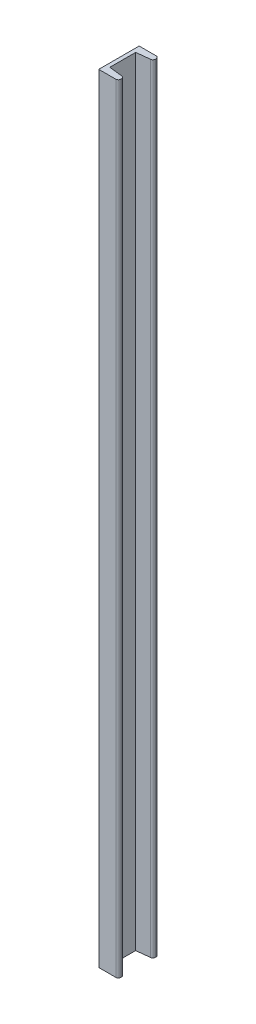
ISO-10303-21;
HEADER;
FILE_DESCRIPTION(('STEP AP214'),'2;1');
FILE_NAME('part.step','',(''),(''),'','','');
FILE_SCHEMA(('AUTOMOTIVE_DESIGN { 1 0 10303 214 1 1 1 1 }'));
ENDSEC;
DATA;
#1=APPLICATION_CONTEXT('core data for automotive mechanical design processes');
#2=APPLICATION_PROTOCOL_DEFINITION('international standard','automotive_design',2000,#1);
#3=PRODUCT_CONTEXT('',#1,'mechanical');
#4=PRODUCT('Part','Part','',(#3));
#5=PRODUCT_RELATED_PRODUCT_CATEGORY('part','',(#4));
#6=PRODUCT_DEFINITION_FORMATION('','',#4);
#7=PRODUCT_DEFINITION_CONTEXT('part definition',#1,'design');
#8=PRODUCT_DEFINITION('design','',#6,#7);
#9=PRODUCT_DEFINITION_SHAPE('','',#8);
#10=(LENGTH_UNIT() NAMED_UNIT(*) SI_UNIT(.MILLI.,.METRE.));
#11=(NAMED_UNIT(*) PLANE_ANGLE_UNIT() SI_UNIT($,.RADIAN.));
#12=(NAMED_UNIT(*) SI_UNIT($,.STERADIAN.) SOLID_ANGLE_UNIT());
#13=UNCERTAINTY_MEASURE_WITH_UNIT(LENGTH_MEASURE(1.E-05),#10,'distance_accuracy_value','');
#14=(GEOMETRIC_REPRESENTATION_CONTEXT(3) GLOBAL_UNCERTAINTY_ASSIGNED_CONTEXT((#13)) GLOBAL_UNIT_ASSIGNED_CONTEXT((#10,
#11,#12)) REPRESENTATION_CONTEXT('',''));
#15=CARTESIAN_POINT('',(0.,0.,0.));
#16=DIRECTION('',(0.,0.,1.));
#17=DIRECTION('',(1.,0.,0.));
#18=AXIS2_PLACEMENT_3D('',#15,#16,#17);
#19=CARTESIAN_POINT('',(0.750000000000001,155.,-6.6));
#20=DIRECTION('',(-1.,0.,0.));
#21=DIRECTION('',(0.,0.,1.));
#22=AXIS2_PLACEMENT_3D('',#19,#20,#21);
#23=PLANE('',#22);
#24=DIRECTION('',(0.,0.,-1.));
#25=VECTOR('',#24,1.);
#26=CARTESIAN_POINT('',(0.750000000000001,0.,-6.6));
#27=LINE('',#26,#25);
#28=CARTESIAN_POINT('',(0.750000000000001,0.,-1.45));
#29=VERTEX_POINT('',#28);
#30=CARTESIAN_POINT('',(0.750000000000001,0.,-6.6));
#31=VERTEX_POINT('',#30);
#32=EDGE_CURVE('E152',#29,#31,#27,.T.);
#33=ORIENTED_EDGE('',*,*,#32,.T.);
#34=DIRECTION('',(0.,-1.,0.));
#35=VECTOR('',#34,1.);
#36=CARTESIAN_POINT('',(0.750000000000001,155.,-6.6));
#37=LINE('',#36,#35);
#38=CARTESIAN_POINT('',(0.750000000000001,155.,-6.6));
#39=VERTEX_POINT('',#38);
#40=EDGE_CURVE('E11',#39,#31,#37,.T.);
#41=ORIENTED_EDGE('',*,*,#40,.F.);
#42=DIRECTION('',(0.,0.,-1.));
#43=VECTOR('',#42,1.);
#44=CARTESIAN_POINT('',(0.750000000000001,155.,-6.6));
#45=LINE('',#44,#43);
#46=CARTESIAN_POINT('',(0.750000000000001,155.,-1.45));
#47=VERTEX_POINT('',#46);
#48=EDGE_CURVE('E174',#47,#39,#45,.T.);
#49=ORIENTED_EDGE('',*,*,#48,.F.);
#50=DIRECTION('',(0.,-1.,0.));
#51=VECTOR('',#50,1.);
#52=CARTESIAN_POINT('',(0.750000000000001,155.,-1.45));
#53=LINE('',#52,#51);
#54=EDGE_CURVE('E148',#47,#29,#53,.T.);
#55=ORIENTED_EDGE('',*,*,#54,.T.);
#56=EDGE_LOOP('',(#33,#41,#49,#55));
#57=FACE_BOUND('',#56,.T.);
#58=ADVANCED_FACE('F32',(#57),#23,.F.);
#59=CARTESIAN_POINT('',(0.750000000000001,155.,-6.6));
#60=DIRECTION('',(-0.110431526074847,0.,-0.993883734673619));
#61=DIRECTION('',(-0.993883734673619,0.,0.110431526074847));
#62=AXIS2_PLACEMENT_3D('',#59,#60,#61);
#63=PLANE('',#62);
#64=DIRECTION('',(0.993883734673619,0.,-0.110431526074847));
#65=VECTOR('',#64,1.);
#66=CARTESIAN_POINT('',(0.750000000000001,0.,-6.6));
#67=LINE('',#66,#65);
#68=CARTESIAN_POINT('',(3.45521576303742,0.,-6.90057952922638));
#69=VERTEX_POINT('',#68);
#70=EDGE_CURVE('E155',#31,#69,#67,.T.);
#71=ORIENTED_EDGE('',*,*,#70,.T.);
#72=DIRECTION('',(0.,-1.,0.));
#73=VECTOR('',#72,1.);
#74=CARTESIAN_POINT('',(3.45521576303742,155.,-6.90057952922638));
#75=LINE('',#74,#73);
#76=CARTESIAN_POINT('',(3.45521576303742,155.,-6.90057952922638));
#77=VERTEX_POINT('',#76);
#78=EDGE_CURVE('E40',#77,#69,#75,.T.);
#79=ORIENTED_EDGE('',*,*,#78,.F.);
#80=DIRECTION('',(0.993883734673619,0.,-0.110431526074847));
#81=VECTOR('',#80,1.);
#82=CARTESIAN_POINT('',(0.750000000000001,155.,-6.6));
#83=LINE('',#82,#81);
#84=EDGE_CURVE('E103',#39,#77,#83,.T.);
#85=ORIENTED_EDGE('',*,*,#84,.F.);
#86=ORIENTED_EDGE('',*,*,#40,.T.);
#87=EDGE_LOOP('',(#71,#79,#85,#86));
#88=FACE_BOUND('',#87,.T.);
#89=ADVANCED_FACE('F252',(#88),#63,.F.);
#90=CARTESIAN_POINT('',(3.4,155.,-7.39752139656319));
#91=DIRECTION('',(0.,-1.,0.));
#92=DIRECTION('',(0.,0.,-1.));
#93=AXIS2_PLACEMENT_3D('',#90,#91,#92);
#94=CYLINDRICAL_SURFACE('',#93,0.5);
#95=CARTESIAN_POINT('',(3.4,0.,-7.39752139656319));
#96=DIRECTION('',(0.,1.,0.));
#97=DIRECTION('',(0.,0.,1.));
#98=AXIS2_PLACEMENT_3D('',#95,#96,#97);
#99=CIRCLE('',#98,0.5);
#100=CARTESIAN_POINT('',(3.9,0.,-7.39752139656319));
#101=VERTEX_POINT('',#100);
#102=EDGE_CURVE('E157',#69,#101,#99,.T.);
#103=ORIENTED_EDGE('',*,*,#102,.T.);
#104=DIRECTION('',(0.,-1.,0.));
#105=VECTOR('',#104,1.);
#106=CARTESIAN_POINT('',(3.9,155.,-7.39752139656319));
#107=LINE('',#106,#105);
#108=CARTESIAN_POINT('',(3.9,155.,-7.39752139656319));
#109=VERTEX_POINT('',#108);
#110=EDGE_CURVE('E193',#109,#101,#107,.T.);
#111=ORIENTED_EDGE('',*,*,#110,.F.);
#112=CARTESIAN_POINT('',(3.4,155.,-7.39752139656319));
#113=DIRECTION('',(0.,1.,0.));
#114=DIRECTION('',(0.,0.,1.));
#115=AXIS2_PLACEMENT_3D('',#112,#113,#114);
#116=CIRCLE('',#115,0.5);
#117=EDGE_CURVE('E201',#77,#109,#116,.T.);
#118=ORIENTED_EDGE('',*,*,#117,.F.);
#119=ORIENTED_EDGE('',*,*,#78,.T.);
#120=EDGE_LOOP('',(#103,#111,#118,#119));
#121=FACE_BOUND('',#120,.T.);
#122=ADVANCED_FACE('F199',(#121),#94,.T.);
#123=CARTESIAN_POINT('',(3.9,155.,-7.39752139656319));
#124=DIRECTION('',(-1.,0.,0.));
#125=DIRECTION('',(0.,0.,1.));
#126=AXIS2_PLACEMENT_3D('',#123,#124,#125);
#127=PLANE('',#126);
#128=DIRECTION('',(0.,0.,-1.));
#129=VECTOR('',#128,1.);
#130=CARTESIAN_POINT('',(3.9,0.,-7.39752139656319));
#131=LINE('',#130,#129);
#132=CARTESIAN_POINT('',(3.9,0.,-7.55));
#133=VERTEX_POINT('',#132);
#134=EDGE_CURVE('E159',#101,#133,#131,.T.);
#135=ORIENTED_EDGE('',*,*,#134,.T.);
#136=DIRECTION('',(0.,-1.,0.));
#137=VECTOR('',#136,1.);
#138=CARTESIAN_POINT('',(3.9,155.,-7.55));
#139=LINE('',#138,#137);
#140=CARTESIAN_POINT('',(3.9,155.,-7.55));
#141=VERTEX_POINT('',#140);
#142=EDGE_CURVE('E190',#141,#133,#139,.T.);
#143=ORIENTED_EDGE('',*,*,#142,.F.);
#144=DIRECTION('',(0.,0.,-1.));
#145=VECTOR('',#144,1.);
#146=CARTESIAN_POINT('',(3.9,155.,-7.39752139656319));
#147=LINE('',#146,#145);
#148=EDGE_CURVE('E219',#109,#141,#147,.T.);
#149=ORIENTED_EDGE('',*,*,#148,.F.);
#150=ORIENTED_EDGE('',*,*,#110,.T.);
#151=EDGE_LOOP('',(#135,#143,#149,#150));
#152=FACE_BOUND('',#151,.T.);
#153=ADVANCED_FACE('F210',(#152),#127,.F.);
#154=CARTESIAN_POINT('',(3.4,155.,-7.55));
#155=DIRECTION('',(0.,-1.,0.));
#156=DIRECTION('',(0.,0.,-1.));
#157=AXIS2_PLACEMENT_3D('',#154,#155,#156);
#158=CYLINDRICAL_SURFACE('',#157,0.5);
#159=CARTESIAN_POINT('',(3.4,0.,-7.55));
#160=DIRECTION('',(0.,1.,0.));
#161=DIRECTION('',(0.,0.,1.));
#162=AXIS2_PLACEMENT_3D('',#159,#160,#161);
#163=CIRCLE('',#162,0.5);
#164=CARTESIAN_POINT('',(3.4,0.,-8.05));
#165=VERTEX_POINT('',#164);
#166=EDGE_CURVE('E161',#133,#165,#163,.T.);
#167=ORIENTED_EDGE('',*,*,#166,.T.);
#168=DIRECTION('',(0.,-1.,0.));
#169=VECTOR('',#168,1.);
#170=CARTESIAN_POINT('',(3.4,155.,-8.05));
#171=LINE('',#170,#169);
#172=CARTESIAN_POINT('',(3.4,155.,-8.05));
#173=VERTEX_POINT('',#172);
#174=EDGE_CURVE('E187',#173,#165,#171,.T.);
#175=ORIENTED_EDGE('',*,*,#174,.F.);
#176=CARTESIAN_POINT('',(3.4,155.,-7.55));
#177=DIRECTION('',(0.,1.,0.));
#178=DIRECTION('',(0.,0.,1.));
#179=AXIS2_PLACEMENT_3D('',#176,#177,#178);
#180=CIRCLE('',#179,0.5);
#181=EDGE_CURVE('E216',#141,#173,#180,.T.);
#182=ORIENTED_EDGE('',*,*,#181,.F.);
#183=ORIENTED_EDGE('',*,*,#142,.T.);
#184=EDGE_LOOP('',(#167,#175,#182,#183));
#185=FACE_BOUND('',#184,.T.);
#186=ADVANCED_FACE('F214',(#185),#158,.T.);
#187=CARTESIAN_POINT('',(3.4,155.,-8.05));
#188=DIRECTION('',(0.,0.,1.));
#189=DIRECTION('',(1.,0.,0.));
#190=AXIS2_PLACEMENT_3D('',#187,#188,#189);
#191=PLANE('',#190);
#192=DIRECTION('',(-1.,0.,0.));
#193=VECTOR('',#192,1.);
#194=CARTESIAN_POINT('',(3.4,0.,-8.05));
#195=LINE('',#194,#193);
#196=CARTESIAN_POINT('',(0.,0.,-8.05));
#197=VERTEX_POINT('',#196);
#198=EDGE_CURVE('E163',#165,#197,#195,.T.);
#199=ORIENTED_EDGE('',*,*,#198,.T.);
#200=DIRECTION('',(0.,-1.,0.));
#201=VECTOR('',#200,1.);
#202=CARTESIAN_POINT('',(0.,155.,-8.05));
#203=LINE('',#202,#201);
#204=CARTESIAN_POINT('',(0.,155.,-8.05));
#205=VERTEX_POINT('',#204);
#206=EDGE_CURVE('E184',#205,#197,#203,.T.);
#207=ORIENTED_EDGE('',*,*,#206,.F.);
#208=DIRECTION('',(-1.,0.,0.));
#209=VECTOR('',#208,1.);
#210=CARTESIAN_POINT('',(3.4,155.,-8.05));
#211=LINE('',#210,#209);
#212=EDGE_CURVE('E218',#173,#205,#211,.T.);
#213=ORIENTED_EDGE('',*,*,#212,.F.);
#214=ORIENTED_EDGE('',*,*,#174,.T.);
#215=EDGE_LOOP('',(#199,#207,#213,#214));
#216=FACE_BOUND('',#215,.T.);
#217=ADVANCED_FACE('F265',(#216),#191,.F.);
#218=CARTESIAN_POINT('',(0.,155.,0.));
#219=DIRECTION('',(1.,0.,0.));
#220=DIRECTION('',(0.,0.,-1.));
#221=AXIS2_PLACEMENT_3D('',#218,#219,#220);
#222=PLANE('',#221);
#223=DIRECTION('',(0.,0.,1.));
#224=VECTOR('',#223,1.);
#225=CARTESIAN_POINT('',(0.,0.,0.));
#226=LINE('',#225,#224);
#227=CARTESIAN_POINT('',(0.,0.,0.));
#228=VERTEX_POINT('',#227);
#229=EDGE_CURVE('E165',#197,#228,#226,.T.);
#230=ORIENTED_EDGE('',*,*,#229,.T.);
#231=DIRECTION('',(0.,-1.,0.));
#232=VECTOR('',#231,1.);
#233=CARTESIAN_POINT('',(0.,155.,0.));
#234=LINE('',#233,#232);
#235=CARTESIAN_POINT('',(0.,155.,0.));
#236=VERTEX_POINT('',#235);
#237=EDGE_CURVE('E181',#236,#228,#234,.T.);
#238=ORIENTED_EDGE('',*,*,#237,.F.);
#239=DIRECTION('',(0.,0.,1.));
#240=VECTOR('',#239,1.);
#241=CARTESIAN_POINT('',(0.,155.,0.));
#242=LINE('',#241,#240);
#243=EDGE_CURVE('E221',#205,#236,#242,.T.);
#244=ORIENTED_EDGE('',*,*,#243,.F.);
#245=ORIENTED_EDGE('',*,*,#206,.T.);
#246=EDGE_LOOP('',(#230,#238,#244,#245));
#247=FACE_BOUND('',#246,.T.);
#248=ADVANCED_FACE('F268',(#247),#222,.F.);
#249=CARTESIAN_POINT('',(3.4,155.,0.));
#250=DIRECTION('',(0.,0.,-1.));
#251=DIRECTION('',(-1.,0.,0.));
#252=AXIS2_PLACEMENT_3D('',#249,#250,#251);
#253=PLANE('',#252);
#254=DIRECTION('',(1.,0.,0.));
#255=VECTOR('',#254,1.);
#256=CARTESIAN_POINT('',(3.4,0.,0.));
#257=LINE('',#256,#255);
#258=CARTESIAN_POINT('',(3.4,0.,0.));
#259=VERTEX_POINT('',#258);
#260=EDGE_CURVE('E167',#228,#259,#257,.T.);
#261=ORIENTED_EDGE('',*,*,#260,.T.);
#262=DIRECTION('',(0.,-1.,0.));
#263=VECTOR('',#262,1.);
#264=CARTESIAN_POINT('',(3.4,155.,0.));
#265=LINE('',#264,#263);
#266=CARTESIAN_POINT('',(3.4,155.,0.));
#267=VERTEX_POINT('',#266);
#268=EDGE_CURVE('E178',#267,#259,#265,.T.);
#269=ORIENTED_EDGE('',*,*,#268,.F.);
#270=DIRECTION('',(1.,0.,0.));
#271=VECTOR('',#270,1.);
#272=CARTESIAN_POINT('',(3.4,155.,0.));
#273=LINE('',#272,#271);
#274=EDGE_CURVE('E227',#236,#267,#273,.T.);
#275=ORIENTED_EDGE('',*,*,#274,.F.);
#276=ORIENTED_EDGE('',*,*,#237,.T.);
#277=EDGE_LOOP('',(#261,#269,#275,#276));
#278=FACE_BOUND('',#277,.T.);
#279=ADVANCED_FACE('F233',(#278),#253,.F.);
#280=CARTESIAN_POINT('',(3.4,155.,-0.5));
#281=DIRECTION('',(0.,-1.,0.));
#282=DIRECTION('',(0.,0.,-1.));
#283=AXIS2_PLACEMENT_3D('',#280,#281,#282);
#284=CYLINDRICAL_SURFACE('',#283,0.5);
#285=CARTESIAN_POINT('',(3.4,0.,-0.5));
#286=DIRECTION('',(0.,1.,0.));
#287=DIRECTION('',(0.,0.,-1.));
#288=AXIS2_PLACEMENT_3D('',#285,#286,#287);
#289=CIRCLE('',#288,0.5);
#290=CARTESIAN_POINT('',(3.9,0.,-0.500000000000004));
#291=VERTEX_POINT('',#290);
#292=EDGE_CURVE('E169',#259,#291,#289,.T.);
#293=ORIENTED_EDGE('',*,*,#292,.T.);
#294=DIRECTION('',(0.,-1.,0.));
#295=VECTOR('',#294,1.);
#296=CARTESIAN_POINT('',(3.9,155.,-0.500000000000004));
#297=LINE('',#296,#295);
#298=CARTESIAN_POINT('',(3.9,155.,-0.500000000000004));
#299=VERTEX_POINT('',#298);
#300=EDGE_CURVE('E143',#299,#291,#297,.T.);
#301=ORIENTED_EDGE('',*,*,#300,.F.);
#302=CARTESIAN_POINT('',(3.4,155.,-0.5));
#303=DIRECTION('',(0.,1.,0.));
#304=DIRECTION('',(0.,0.,-1.));
#305=AXIS2_PLACEMENT_3D('',#302,#303,#304);
#306=CIRCLE('',#305,0.5);
#307=EDGE_CURVE('E134',#267,#299,#306,.T.);
#308=ORIENTED_EDGE('',*,*,#307,.F.);
#309=ORIENTED_EDGE('',*,*,#268,.T.);
#310=EDGE_LOOP('',(#293,#301,#308,#309));
#311=FACE_BOUND('',#310,.T.);
#312=ADVANCED_FACE('F237',(#311),#284,.T.);
#313=CARTESIAN_POINT('',(3.9,155.,-0.652478603436806));
#314=DIRECTION('',(-1.,0.,0.));
#315=DIRECTION('',(0.,0.,1.));
#316=AXIS2_PLACEMENT_3D('',#313,#314,#315);
#317=PLANE('',#316);
#318=DIRECTION('',(0.,0.,-1.));
#319=VECTOR('',#318,1.);
#320=CARTESIAN_POINT('',(3.9,0.,-0.652478603436806));
#321=LINE('',#320,#319);
#322=CARTESIAN_POINT('',(3.9,0.,-0.652478603436806));
#323=VERTEX_POINT('',#322);
#324=EDGE_CURVE('E142',#291,#323,#321,.T.);
#325=ORIENTED_EDGE('',*,*,#324,.T.);
#326=DIRECTION('',(0.,-1.,0.));
#327=VECTOR('',#326,1.);
#328=CARTESIAN_POINT('',(3.9,155.,-0.652478603436806));
#329=LINE('',#328,#327);
#330=CARTESIAN_POINT('',(3.9,155.,-0.652478603436806));
#331=VERTEX_POINT('',#330);
#332=EDGE_CURVE('E139',#331,#323,#329,.T.);
#333=ORIENTED_EDGE('',*,*,#332,.F.);
#334=DIRECTION('',(0.,0.,-1.));
#335=VECTOR('',#334,1.);
#336=CARTESIAN_POINT('',(3.9,155.,-0.652478603436806));
#337=LINE('',#336,#335);
#338=EDGE_CURVE('E128',#299,#331,#337,.T.);
#339=ORIENTED_EDGE('',*,*,#338,.F.);
#340=ORIENTED_EDGE('',*,*,#300,.T.);
#341=EDGE_LOOP('',(#325,#333,#339,#340));
#342=FACE_BOUND('',#341,.T.);
#343=ADVANCED_FACE('F140',(#342),#317,.F.);
#344=CARTESIAN_POINT('',(3.4,155.,-0.65247860343681));
#345=DIRECTION('',(0.,-1.,0.));
#346=DIRECTION('',(0.,0.,-1.));
#347=AXIS2_PLACEMENT_3D('',#344,#345,#346);
#348=CYLINDRICAL_SURFACE('',#347,0.5);
#349=CARTESIAN_POINT('',(3.4,0.,-0.65247860343681));
#350=DIRECTION('',(0.,1.,0.));
#351=DIRECTION('',(0.,0.,-1.));
#352=AXIS2_PLACEMENT_3D('',#349,#350,#351);
#353=CIRCLE('',#352,0.5);
#354=CARTESIAN_POINT('',(3.45521576303742,0.,-1.14942047077362));
#355=VERTEX_POINT('',#354);
#356=EDGE_CURVE('E89',#323,#355,#353,.T.);
#357=ORIENTED_EDGE('',*,*,#356,.T.);
#358=DIRECTION('',(0.,-1.,0.));
#359=VECTOR('',#358,1.);
#360=CARTESIAN_POINT('',(3.45521576303742,155.,-1.14942047077362));
#361=LINE('',#360,#359);
#362=CARTESIAN_POINT('',(3.45521576303742,155.,-1.14942047077362));
#363=VERTEX_POINT('',#362);
#364=EDGE_CURVE('E144',#363,#355,#361,.T.);
#365=ORIENTED_EDGE('',*,*,#364,.F.);
#366=CARTESIAN_POINT('',(3.4,155.,-0.65247860343681));
#367=DIRECTION('',(0.,1.,0.));
#368=DIRECTION('',(0.,0.,-1.));
#369=AXIS2_PLACEMENT_3D('',#366,#367,#368);
#370=CIRCLE('',#369,0.5);
#371=EDGE_CURVE('E132',#331,#363,#370,.T.);
#372=ORIENTED_EDGE('',*,*,#371,.F.);
#373=ORIENTED_EDGE('',*,*,#332,.T.);
#374=EDGE_LOOP('',(#357,#365,#372,#373));
#375=FACE_BOUND('',#374,.T.);
#376=ADVANCED_FACE('F146',(#375),#348,.T.);
#377=CARTESIAN_POINT('',(0.750000000000001,155.,-1.45));
#378=DIRECTION('',(-0.110431526074847,0.,0.993883734673619));
#379=DIRECTION('',(0.993883734673619,0.,0.110431526074847));
#380=AXIS2_PLACEMENT_3D('',#377,#378,#379);
#381=PLANE('',#380);
#382=DIRECTION('',(-0.993883734673619,0.,-0.110431526074847));
#383=VECTOR('',#382,1.);
#384=CARTESIAN_POINT('',(0.750000000000001,0.,-1.45));
#385=LINE('',#384,#383);
#386=EDGE_CURVE('E95',#355,#29,#385,.T.);
#387=ORIENTED_EDGE('',*,*,#386,.T.);
#388=ORIENTED_EDGE('',*,*,#54,.F.);
#389=DIRECTION('',(-0.993883734673619,0.,-0.110431526074847));
#390=VECTOR('',#389,1.);
#391=CARTESIAN_POINT('',(0.750000000000001,155.,-1.45));
#392=LINE('',#391,#390);
#393=EDGE_CURVE('E48',#363,#47,#392,.T.);
#394=ORIENTED_EDGE('',*,*,#393,.F.);
#395=ORIENTED_EDGE('',*,*,#364,.T.);
#396=EDGE_LOOP('',(#387,#388,#394,#395));
#397=FACE_BOUND('',#396,.T.);
#398=ADVANCED_FACE('F241',(#397),#381,.F.);
#399=CARTESIAN_POINT('',(3.4,155.,-0.65247860343681));
#400=DIRECTION('',(0.,-1.,0.));
#401=DIRECTION('',(0.,0.,-1.));
#402=AXIS2_PLACEMENT_3D('',#399,#400,#401);
#403=PLANE('',#402);
#404=ORIENTED_EDGE('',*,*,#48,.T.);
#405=ORIENTED_EDGE('',*,*,#84,.T.);
#406=ORIENTED_EDGE('',*,*,#117,.T.);
#407=ORIENTED_EDGE('',*,*,#148,.T.);
#408=ORIENTED_EDGE('',*,*,#181,.T.);
#409=ORIENTED_EDGE('',*,*,#212,.T.);
#410=ORIENTED_EDGE('',*,*,#243,.T.);
#411=ORIENTED_EDGE('',*,*,#274,.T.);
#412=ORIENTED_EDGE('',*,*,#307,.T.);
#413=ORIENTED_EDGE('',*,*,#338,.T.);
#414=ORIENTED_EDGE('',*,*,#371,.T.);
#415=ORIENTED_EDGE('',*,*,#393,.T.);
#416=EDGE_LOOP('',(#404,#405,#406,#407,#408,#409,#410,#411,#412,#413,#414,#415));
#417=FACE_BOUND('',#416,.T.);
#418=ADVANCED_FACE('F130',(#417),#403,.F.);
#419=CARTESIAN_POINT('',(3.4,0.,-0.65247860343681));
#420=DIRECTION('',(0.,-1.,0.));
#421=DIRECTION('',(0.,0.,-1.));
#422=AXIS2_PLACEMENT_3D('',#419,#420,#421);
#423=PLANE('',#422);
#424=ORIENTED_EDGE('',*,*,#32,.F.);
#425=ORIENTED_EDGE('',*,*,#386,.F.);
#426=ORIENTED_EDGE('',*,*,#356,.F.);
#427=ORIENTED_EDGE('',*,*,#324,.F.);
#428=ORIENTED_EDGE('',*,*,#292,.F.);
#429=ORIENTED_EDGE('',*,*,#260,.F.);
#430=ORIENTED_EDGE('',*,*,#229,.F.);
#431=ORIENTED_EDGE('',*,*,#198,.F.);
#432=ORIENTED_EDGE('',*,*,#166,.F.);
#433=ORIENTED_EDGE('',*,*,#134,.F.);
#434=ORIENTED_EDGE('',*,*,#102,.F.);
#435=ORIENTED_EDGE('',*,*,#70,.F.);
#436=EDGE_LOOP('',(#424,#425,#426,#427,#428,#429,#430,#431,#432,#433,#434,#435));
#437=FACE_BOUND('',#436,.T.);
#438=ADVANCED_FACE('F205',(#437),#423,.T.);
#439=CLOSED_SHELL('',(#58,#89,#122,#153,#186,#217,#248,#279,#312,#343,#376,#398,#418,#438));
#440=MANIFOLD_SOLID_BREP('B2',#439);
#441=ADVANCED_BREP_SHAPE_REPRESENTATION('',(#18,#440),#14);
#442=SHAPE_DEFINITION_REPRESENTATION(#9,#441);
ENDSEC;
END-ISO-10303-21;
